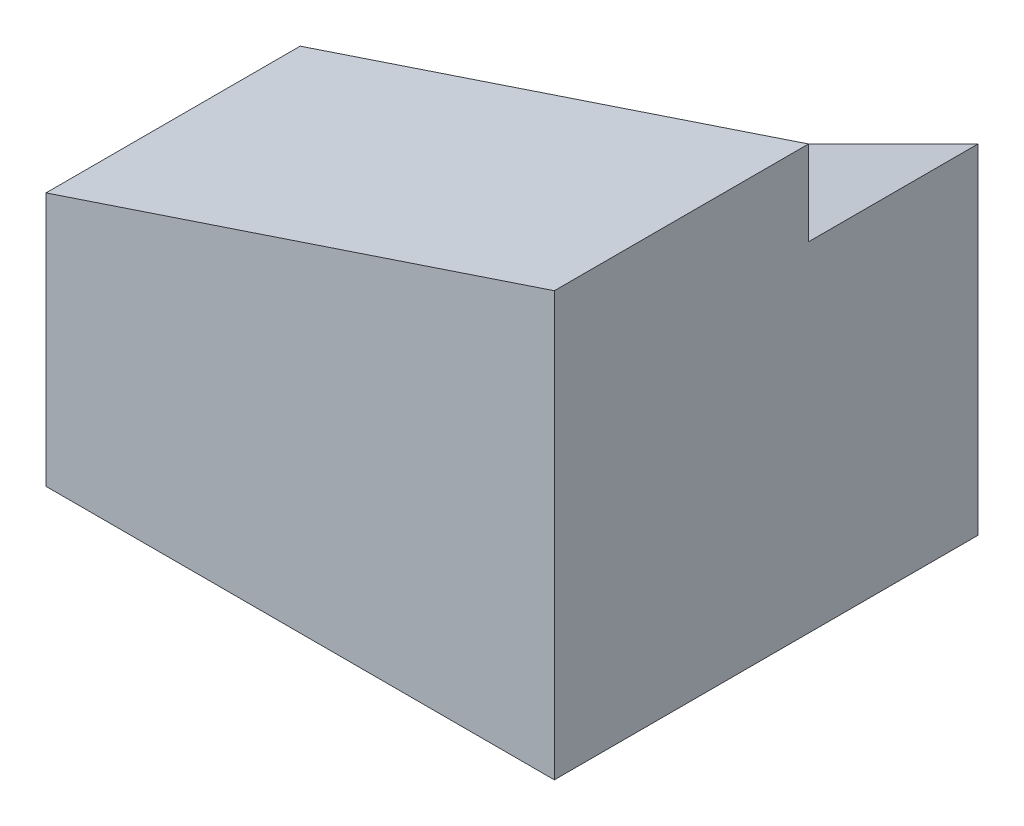
ISO-10303-21;
HEADER;
FILE_DESCRIPTION(('STEP AP214'),'2;1');
FILE_NAME('part.step','',(''),(''),'','','');
FILE_SCHEMA(('AUTOMOTIVE_DESIGN { 1 0 10303 214 1 1 1 1 }'));
ENDSEC;
DATA;
#1=APPLICATION_CONTEXT('core data for automotive mechanical design processes');
#2=APPLICATION_PROTOCOL_DEFINITION('international standard','automotive_design',2000,#1);
#3=PRODUCT_CONTEXT('',#1,'mechanical');
#4=PRODUCT('Part','Part','',(#3));
#5=PRODUCT_RELATED_PRODUCT_CATEGORY('part','',(#4));
#6=PRODUCT_DEFINITION_FORMATION('','',#4);
#7=PRODUCT_DEFINITION_CONTEXT('part definition',#1,'design');
#8=PRODUCT_DEFINITION('design','',#6,#7);
#9=PRODUCT_DEFINITION_SHAPE('','',#8);
#10=(LENGTH_UNIT() NAMED_UNIT(*) SI_UNIT(.MILLI.,.METRE.));
#11=(NAMED_UNIT(*) PLANE_ANGLE_UNIT() SI_UNIT($,.RADIAN.));
#12=(NAMED_UNIT(*) SI_UNIT($,.STERADIAN.) SOLID_ANGLE_UNIT());
#13=UNCERTAINTY_MEASURE_WITH_UNIT(LENGTH_MEASURE(1.E-05),#10,'distance_accuracy_value','');
#14=(GEOMETRIC_REPRESENTATION_CONTEXT(3) GLOBAL_UNCERTAINTY_ASSIGNED_CONTEXT((#13)) GLOBAL_UNIT_ASSIGNED_CONTEXT((#10,
#11,#12)) REPRESENTATION_CONTEXT('',''));
#15=CARTESIAN_POINT('',(0.,0.,0.));
#16=DIRECTION('',(0.,0.,1.));
#17=DIRECTION('',(1.,0.,0.));
#18=AXIS2_PLACEMENT_3D('',#15,#16,#17);
#19=CARTESIAN_POINT('',(15.,12.5,0.));
#20=DIRECTION('',(0.316227766016838,-0.948683298050514,0.));
#21=DIRECTION('',(0.948683298050514,0.316227766016838,0.));
#22=AXIS2_PLACEMENT_3D('',#19,#20,#21);
#23=PLANE('',#22);
#24=DIRECTION('',(0.948683298050514,0.316227766016838,0.));
#25=VECTOR('',#24,1.);
#26=CARTESIAN_POINT('',(-15.,2.5,10.));
#27=LINE('',#26,#25);
#28=CARTESIAN_POINT('',(-15.,2.5,10.));
#29=VERTEX_POINT('',#28);
#30=CARTESIAN_POINT('',(15.,12.5,10.));
#31=VERTEX_POINT('',#30);
#32=EDGE_CURVE('E113',#29,#31,#27,.T.);
#33=ORIENTED_EDGE('',*,*,#32,.F.);
#34=DIRECTION('',(0.,0.,1.));
#35=VECTOR('',#34,1.);
#36=CARTESIAN_POINT('',(-15.,2.5,0.));
#37=LINE('',#36,#35);
#38=CARTESIAN_POINT('',(-15.,2.5,25.));
#39=VERTEX_POINT('',#38);
#40=EDGE_CURVE('E93',#29,#39,#37,.T.);
#41=ORIENTED_EDGE('',*,*,#40,.T.);
#42=DIRECTION('',(0.948683298050514,0.316227766016838,0.));
#43=VECTOR('',#42,1.);
#44=CARTESIAN_POINT('',(15.,12.5,25.));
#45=LINE('',#44,#43);
#46=CARTESIAN_POINT('',(15.,12.5,25.));
#47=VERTEX_POINT('',#46);
#48=EDGE_CURVE('E97',#39,#47,#45,.T.);
#49=ORIENTED_EDGE('',*,*,#48,.T.);
#50=DIRECTION('',(0.,0.,-1.));
#51=VECTOR('',#50,1.);
#52=CARTESIAN_POINT('',(15.,12.5,25.));
#53=LINE('',#52,#51);
#54=EDGE_CURVE('E11',#47,#31,#53,.T.);
#55=ORIENTED_EDGE('',*,*,#54,.T.);
#56=EDGE_LOOP('',(#33,#41,#49,#55));
#57=FACE_BOUND('',#56,.T.);
#58=ADVANCED_FACE('F33',(#57),#23,.F.);
#59=CARTESIAN_POINT('',(15.,12.5,25.));
#60=DIRECTION('',(-1.,0.,0.));
#61=DIRECTION('',(0.,-1.,0.));
#62=AXIS2_PLACEMENT_3D('',#59,#60,#61);
#63=PLANE('',#62);
#64=DIRECTION('',(0.,1.,0.));
#65=VECTOR('',#64,1.);
#66=CARTESIAN_POINT('',(15.,12.5,0.));
#67=LINE('',#66,#65);
#68=CARTESIAN_POINT('',(15.,-12.5,0.));
#69=VERTEX_POINT('',#68);
#70=CARTESIAN_POINT('',(15.,7.5,0.));
#71=VERTEX_POINT('',#70);
#72=EDGE_CURVE('E86',#69,#71,#67,.T.);
#73=ORIENTED_EDGE('',*,*,#72,.T.);
#74=DIRECTION('',(0.,0.,-1.));
#75=VECTOR('',#74,1.);
#76=CARTESIAN_POINT('',(15.,7.5,10.));
#77=LINE('',#76,#75);
#78=CARTESIAN_POINT('',(15.,7.5,10.));
#79=VERTEX_POINT('',#78);
#80=EDGE_CURVE('E107',#79,#71,#77,.T.);
#81=ORIENTED_EDGE('',*,*,#80,.F.);
#82=DIRECTION('',(0.,-1.,0.));
#83=VECTOR('',#82,1.);
#84=CARTESIAN_POINT('',(15.,12.5,10.));
#85=LINE('',#84,#83);
#86=EDGE_CURVE('E117',#31,#79,#85,.T.);
#87=ORIENTED_EDGE('',*,*,#86,.F.);
#88=ORIENTED_EDGE('',*,*,#54,.F.);
#89=DIRECTION('',(0.,1.,0.));
#90=VECTOR('',#89,1.);
#91=CARTESIAN_POINT('',(15.,12.5,25.));
#92=LINE('',#91,#90);
#93=CARTESIAN_POINT('',(15.,-12.5,25.));
#94=VERTEX_POINT('',#93);
#95=EDGE_CURVE('E79',#94,#47,#92,.T.);
#96=ORIENTED_EDGE('',*,*,#95,.F.);
#97=DIRECTION('',(0.,0.,-1.));
#98=VECTOR('',#97,1.);
#99=CARTESIAN_POINT('',(15.,-12.5,25.));
#100=LINE('',#99,#98);
#101=EDGE_CURVE('E73',#94,#69,#100,.T.);
#102=ORIENTED_EDGE('',*,*,#101,.T.);
#103=EDGE_LOOP('',(#73,#81,#87,#88,#96,#102));
#104=FACE_BOUND('',#103,.T.);
#105=ADVANCED_FACE('F35',(#104),#63,.F.);
#106=CARTESIAN_POINT('',(-15.,12.5,25.));
#107=DIRECTION('',(1.,0.,0.));
#108=DIRECTION('',(0.,1.,0.));
#109=AXIS2_PLACEMENT_3D('',#106,#107,#108);
#110=PLANE('',#109);
#111=DIRECTION('',(0.,1.,0.));
#112=VECTOR('',#111,1.);
#113=CARTESIAN_POINT('',(-15.,-7.5,10.));
#114=LINE('',#113,#112);
#115=CARTESIAN_POINT('',(-15.,-7.5,10.));
#116=VERTEX_POINT('',#115);
#117=EDGE_CURVE('E48',#116,#29,#114,.T.);
#118=ORIENTED_EDGE('',*,*,#117,.F.);
#119=DIRECTION('',(0.,0.,-1.));
#120=VECTOR('',#119,1.);
#121=CARTESIAN_POINT('',(-15.,-7.5,10.));
#122=LINE('',#121,#120);
#123=CARTESIAN_POINT('',(-15.,-7.5,0.));
#124=VERTEX_POINT('',#123);
#125=EDGE_CURVE('E106',#116,#124,#122,.T.);
#126=ORIENTED_EDGE('',*,*,#125,.T.);
#127=DIRECTION('',(0.,-1.,0.));
#128=VECTOR('',#127,1.);
#129=CARTESIAN_POINT('',(-15.,12.5,0.));
#130=LINE('',#129,#128);
#131=CARTESIAN_POINT('',(-15.,-12.5,0.));
#132=VERTEX_POINT('',#131);
#133=EDGE_CURVE('E80',#124,#132,#130,.T.);
#134=ORIENTED_EDGE('',*,*,#133,.T.);
#135=DIRECTION('',(0.,0.,-1.));
#136=VECTOR('',#135,1.);
#137=CARTESIAN_POINT('',(-15.,-12.5,25.));
#138=LINE('',#137,#136);
#139=CARTESIAN_POINT('',(-15.,-12.5,25.));
#140=VERTEX_POINT('',#139);
#141=EDGE_CURVE('E41',#140,#132,#138,.T.);
#142=ORIENTED_EDGE('',*,*,#141,.F.);
#143=DIRECTION('',(0.,-1.,0.));
#144=VECTOR('',#143,1.);
#145=CARTESIAN_POINT('',(-15.,12.5,25.));
#146=LINE('',#145,#144);
#147=EDGE_CURVE('E101',#39,#140,#146,.T.);
#148=ORIENTED_EDGE('',*,*,#147,.F.);
#149=ORIENTED_EDGE('',*,*,#40,.F.);
#150=EDGE_LOOP('',(#118,#126,#134,#142,#148,#149));
#151=FACE_BOUND('',#150,.T.);
#152=ADVANCED_FACE('F140',(#151),#110,.F.);
#153=CARTESIAN_POINT('',(-15.,-12.5,25.));
#154=DIRECTION('',(0.,1.,0.));
#155=DIRECTION('',(0.,0.,1.));
#156=AXIS2_PLACEMENT_3D('',#153,#154,#155);
#157=PLANE('',#156);
#158=DIRECTION('',(1.,0.,0.));
#159=VECTOR('',#158,1.);
#160=CARTESIAN_POINT('',(-15.,-12.5,0.));
#161=LINE('',#160,#159);
#162=EDGE_CURVE('E70',#132,#69,#161,.T.);
#163=ORIENTED_EDGE('',*,*,#162,.T.);
#164=ORIENTED_EDGE('',*,*,#101,.F.);
#165=DIRECTION('',(1.,0.,0.));
#166=VECTOR('',#165,1.);
#167=CARTESIAN_POINT('',(-15.,-12.5,25.));
#168=LINE('',#167,#166);
#169=EDGE_CURVE('E57',#140,#94,#168,.T.);
#170=ORIENTED_EDGE('',*,*,#169,.F.);
#171=ORIENTED_EDGE('',*,*,#141,.T.);
#172=EDGE_LOOP('',(#163,#164,#170,#171));
#173=FACE_BOUND('',#172,.T.);
#174=ADVANCED_FACE('F72',(#173),#157,.F.);
#175=CARTESIAN_POINT('',(0.,0.,25.));
#176=DIRECTION('',(0.,0.,1.));
#177=DIRECTION('',(1.,0.,0.));
#178=AXIS2_PLACEMENT_3D('',#175,#176,#177);
#179=PLANE('',#178);
#180=ORIENTED_EDGE('',*,*,#48,.F.);
#181=ORIENTED_EDGE('',*,*,#147,.T.);
#182=ORIENTED_EDGE('',*,*,#169,.T.);
#183=ORIENTED_EDGE('',*,*,#95,.T.);
#184=EDGE_LOOP('',(#180,#181,#182,#183));
#185=FACE_BOUND('',#184,.T.);
#186=ADVANCED_FACE('F131',(#185),#179,.T.);
#187=CARTESIAN_POINT('',(0.,0.,0.));
#188=DIRECTION('',(0.,0.,1.));
#189=DIRECTION('',(1.,0.,0.));
#190=AXIS2_PLACEMENT_3D('',#187,#188,#189);
#191=PLANE('',#190);
#192=ORIENTED_EDGE('',*,*,#133,.F.);
#193=DIRECTION('',(-0.894427190999916,-0.447213595499958,0.));
#194=VECTOR('',#193,1.);
#195=CARTESIAN_POINT('',(15.,7.5,0.));
#196=LINE('',#195,#194);
#197=EDGE_CURVE('E92',#71,#124,#196,.T.);
#198=ORIENTED_EDGE('',*,*,#197,.F.);
#199=ORIENTED_EDGE('',*,*,#72,.F.);
#200=ORIENTED_EDGE('',*,*,#162,.F.);
#201=EDGE_LOOP('',(#192,#198,#199,#200));
#202=FACE_BOUND('',#201,.T.);
#203=ADVANCED_FACE('F90',(#202),#191,.F.);
#204=CARTESIAN_POINT('',(15.,7.5,10.));
#205=DIRECTION('',(0.447213595499958,-0.894427190999916,0.));
#206=DIRECTION('',(0.894427190999916,0.447213595499958,0.));
#207=AXIS2_PLACEMENT_3D('',#204,#205,#206);
#208=PLANE('',#207);
#209=ORIENTED_EDGE('',*,*,#197,.T.);
#210=ORIENTED_EDGE('',*,*,#125,.F.);
#211=DIRECTION('',(-0.894427190999916,-0.447213595499958,0.));
#212=VECTOR('',#211,1.);
#213=CARTESIAN_POINT('',(15.,7.5,10.));
#214=LINE('',#213,#212);
#215=EDGE_CURVE('E115',#79,#116,#214,.T.);
#216=ORIENTED_EDGE('',*,*,#215,.F.);
#217=ORIENTED_EDGE('',*,*,#80,.T.);
#218=EDGE_LOOP('',(#209,#210,#216,#217));
#219=FACE_BOUND('',#218,.T.);
#220=ADVANCED_FACE('F138',(#219),#208,.F.);
#221=CARTESIAN_POINT('',(0.,0.,10.));
#222=DIRECTION('',(0.,0.,-1.));
#223=DIRECTION('',(-1.,0.,0.));
#224=AXIS2_PLACEMENT_3D('',#221,#222,#223);
#225=PLANE('',#224);
#226=ORIENTED_EDGE('',*,*,#32,.T.);
#227=ORIENTED_EDGE('',*,*,#86,.T.);
#228=ORIENTED_EDGE('',*,*,#215,.T.);
#229=ORIENTED_EDGE('',*,*,#117,.T.);
#230=EDGE_LOOP('',(#226,#227,#228,#229));
#231=FACE_BOUND('',#230,.T.);
#232=ADVANCED_FACE('F122',(#231),#225,.T.);
#233=CLOSED_SHELL('',(#58,#105,#152,#174,#186,#203,#220,#232));
#234=MANIFOLD_SOLID_BREP('B2',#233);
#235=ADVANCED_BREP_SHAPE_REPRESENTATION('',(#18,#234),#14);
#236=SHAPE_DEFINITION_REPRESENTATION(#9,#235);
ENDSEC;
END-ISO-10303-21;
